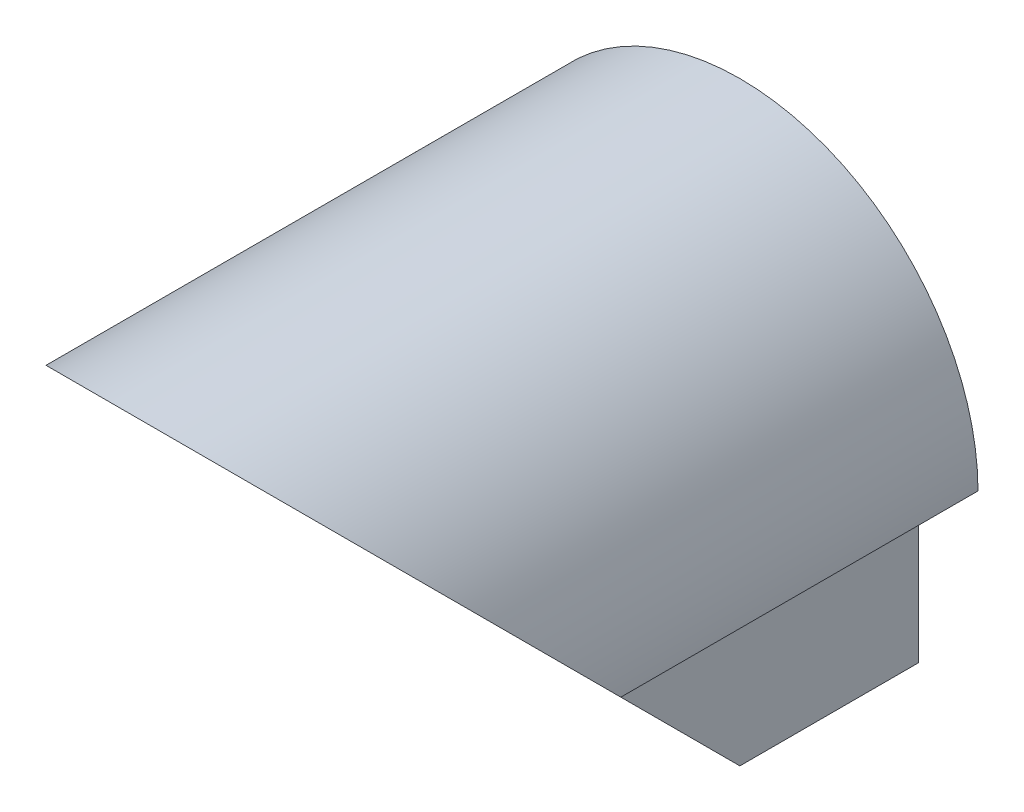
ISO-10303-21;
HEADER;
FILE_DESCRIPTION(('STEP AP214'),'2;1');
FILE_NAME('part.step','',(''),(''),'','','');
FILE_SCHEMA(('AUTOMOTIVE_DESIGN { 1 0 10303 214 1 1 1 1 }'));
ENDSEC;
DATA;
#1=APPLICATION_CONTEXT('core data for automotive mechanical design processes');
#2=APPLICATION_PROTOCOL_DEFINITION('international standard','automotive_design',2000,#1);
#3=PRODUCT_CONTEXT('',#1,'mechanical');
#4=PRODUCT('Part','Part','',(#3));
#5=PRODUCT_RELATED_PRODUCT_CATEGORY('part','',(#4));
#6=PRODUCT_DEFINITION_FORMATION('','',#4);
#7=PRODUCT_DEFINITION_CONTEXT('part definition',#1,'design');
#8=PRODUCT_DEFINITION('design','',#6,#7);
#9=PRODUCT_DEFINITION_SHAPE('','',#8);
#10=(LENGTH_UNIT() NAMED_UNIT(*) SI_UNIT(.MILLI.,.METRE.));
#11=(NAMED_UNIT(*) PLANE_ANGLE_UNIT() SI_UNIT($,.RADIAN.));
#12=(NAMED_UNIT(*) SI_UNIT($,.STERADIAN.) SOLID_ANGLE_UNIT());
#13=UNCERTAINTY_MEASURE_WITH_UNIT(LENGTH_MEASURE(1.E-05),#10,'distance_accuracy_value','');
#14=(GEOMETRIC_REPRESENTATION_CONTEXT(3) GLOBAL_UNCERTAINTY_ASSIGNED_CONTEXT((#13)) GLOBAL_UNIT_ASSIGNED_CONTEXT((#10,
#11,#12)) REPRESENTATION_CONTEXT('',''));
#15=CARTESIAN_POINT('',(0.,0.,0.));
#16=DIRECTION('',(0.,0.,1.));
#17=DIRECTION('',(1.,0.,0.));
#18=AXIS2_PLACEMENT_3D('',#15,#16,#17);
#19=CARTESIAN_POINT('',(0.,-1.,-5.));
#20=DIRECTION('',(0.,0.,-1.));
#21=DIRECTION('',(-1.,0.,0.));
#22=AXIS2_PLACEMENT_3D('',#19,#20,#21);
#23=PLANE('',#22);
#24=CARTESIAN_POINT('',(0.,-1.,-5.));
#25=DIRECTION('',(0.,0.,1.));
#26=DIRECTION('',(-1.,0.,0.));
#27=AXIS2_PLACEMENT_3D('',#24,#25,#26);
#28=CIRCLE('',#27,4.);
#29=CARTESIAN_POINT('',(4.,-0.999999999999999,-5.));
#30=VERTEX_POINT('',#29);
#31=CARTESIAN_POINT('',(-4.,-1.,-5.));
#32=VERTEX_POINT('',#31);
#33=EDGE_CURVE('E211',#30,#32,#28,.T.);
#34=ORIENTED_EDGE('',*,*,#33,.F.);
#35=DIRECTION('',(1.,0.,0.));
#36=VECTOR('',#35,1.);
#37=CARTESIAN_POINT('',(3.,-0.999999999999999,-5.));
#38=LINE('',#37,#36);
#39=CARTESIAN_POINT('',(3.,-0.999999999999999,-5.));
#40=VERTEX_POINT('',#39);
#41=EDGE_CURVE('E172',#40,#30,#38,.T.);
#42=ORIENTED_EDGE('',*,*,#41,.F.);
#43=DIRECTION('',(0.,1.,0.));
#44=VECTOR('',#43,1.);
#45=CARTESIAN_POINT('',(3.,-4.,-5.));
#46=LINE('',#45,#44);
#47=CARTESIAN_POINT('',(3.,-4.,-5.));
#48=VERTEX_POINT('',#47);
#49=EDGE_CURVE('E178',#48,#40,#46,.T.);
#50=ORIENTED_EDGE('',*,*,#49,.F.);
#51=DIRECTION('',(1.,0.,0.));
#52=VECTOR('',#51,1.);
#53=CARTESIAN_POINT('',(2.,-4.,-5.));
#54=LINE('',#53,#52);
#55=CARTESIAN_POINT('',(2.,-4.,-5.));
#56=VERTEX_POINT('',#55);
#57=EDGE_CURVE('E247',#56,#48,#54,.T.);
#58=ORIENTED_EDGE('',*,*,#57,.F.);
#59=DIRECTION('',(0.,-1.,0.));
#60=VECTOR('',#59,1.);
#61=CARTESIAN_POINT('',(2.,-3.,-5.));
#62=LINE('',#61,#60);
#63=CARTESIAN_POINT('',(2.,-3.,-5.));
#64=VERTEX_POINT('',#63);
#65=EDGE_CURVE('E244',#64,#56,#62,.T.);
#66=ORIENTED_EDGE('',*,*,#65,.F.);
#67=DIRECTION('',(1.,0.,0.));
#68=VECTOR('',#67,1.);
#69=CARTESIAN_POINT('',(1.,-3.,-5.));
#70=LINE('',#69,#68);
#71=CARTESIAN_POINT('',(1.,-3.,-5.));
#72=VERTEX_POINT('',#71);
#73=EDGE_CURVE('E241',#72,#64,#70,.T.);
#74=ORIENTED_EDGE('',*,*,#73,.F.);
#75=DIRECTION('',(0.,-1.,0.));
#76=VECTOR('',#75,1.);
#77=CARTESIAN_POINT('',(1.,-2.,-5.));
#78=LINE('',#77,#76);
#79=CARTESIAN_POINT('',(1.,-2.,-5.));
#80=VERTEX_POINT('',#79);
#81=EDGE_CURVE('E238',#80,#72,#78,.T.);
#82=ORIENTED_EDGE('',*,*,#81,.F.);
#83=DIRECTION('',(1.,0.,0.));
#84=VECTOR('',#83,1.);
#85=CARTESIAN_POINT('',(-0.999999999999999,-2.,-5.));
#86=LINE('',#85,#84);
#87=CARTESIAN_POINT('',(-0.999999999999999,-2.,-5.));
#88=VERTEX_POINT('',#87);
#89=EDGE_CURVE('E235',#88,#80,#86,.T.);
#90=ORIENTED_EDGE('',*,*,#89,.F.);
#91=DIRECTION('',(0.,1.,0.));
#92=VECTOR('',#91,1.);
#93=CARTESIAN_POINT('',(-0.999999999999999,-3.,-5.));
#94=LINE('',#93,#92);
#95=CARTESIAN_POINT('',(-0.999999999999999,-3.,-5.));
#96=VERTEX_POINT('',#95);
#97=EDGE_CURVE('E232',#96,#88,#94,.T.);
#98=ORIENTED_EDGE('',*,*,#97,.F.);
#99=DIRECTION('',(1.,0.,0.));
#100=VECTOR('',#99,1.);
#101=CARTESIAN_POINT('',(-2.,-3.,-5.));
#102=LINE('',#101,#100);
#103=CARTESIAN_POINT('',(-2.,-3.,-5.));
#104=VERTEX_POINT('',#103);
#105=EDGE_CURVE('E229',#104,#96,#102,.T.);
#106=ORIENTED_EDGE('',*,*,#105,.F.);
#107=DIRECTION('',(0.,1.,0.));
#108=VECTOR('',#107,1.);
#109=CARTESIAN_POINT('',(-2.,-4.,-5.));
#110=LINE('',#109,#108);
#111=CARTESIAN_POINT('',(-2.,-4.,-5.));
#112=VERTEX_POINT('',#111);
#113=EDGE_CURVE('E226',#112,#104,#110,.T.);
#114=ORIENTED_EDGE('',*,*,#113,.F.);
#115=DIRECTION('',(1.,0.,0.));
#116=VECTOR('',#115,1.);
#117=CARTESIAN_POINT('',(-3.,-4.,-5.));
#118=LINE('',#117,#116);
#119=CARTESIAN_POINT('',(-3.,-4.,-5.));
#120=VERTEX_POINT('',#119);
#121=EDGE_CURVE('E223',#120,#112,#118,.T.);
#122=ORIENTED_EDGE('',*,*,#121,.F.);
#123=DIRECTION('',(0.,-1.,0.));
#124=VECTOR('',#123,1.);
#125=CARTESIAN_POINT('',(-3.,-1.,-5.));
#126=LINE('',#125,#124);
#127=CARTESIAN_POINT('',(-3.,-1.,-5.));
#128=VERTEX_POINT('',#127);
#129=EDGE_CURVE('E214',#128,#120,#126,.T.);
#130=ORIENTED_EDGE('',*,*,#129,.F.);
#131=DIRECTION('',(1.,0.,0.));
#132=VECTOR('',#131,1.);
#133=CARTESIAN_POINT('',(-4.,-1.,-5.));
#134=LINE('',#133,#132);
#135=EDGE_CURVE('E207',#32,#128,#134,.T.);
#136=ORIENTED_EDGE('',*,*,#135,.F.);
#137=EDGE_LOOP('',(#34,#42,#50,#58,#66,#74,#82,#90,#98,#106,#114,#122,#130,#136));
#138=FACE_BOUND('',#137,.T.);
#139=DIRECTION('',(1.,0.,0.));
#140=VECTOR('',#139,1.);
#141=CARTESIAN_POINT('',(-2.,-1.,-5.));
#142=LINE('',#141,#140);
#143=CARTESIAN_POINT('',(-2.,-1.,-5.));
#144=VERTEX_POINT('',#143);
#145=CARTESIAN_POINT('',(2.,-1.,-5.));
#146=VERTEX_POINT('',#145);
#147=EDGE_CURVE('E330',#144,#146,#142,.T.);
#148=ORIENTED_EDGE('',*,*,#147,.T.);
#149=DIRECTION('',(0.,1.,0.));
#150=VECTOR('',#149,1.);
#151=CARTESIAN_POINT('',(2.,-1.,-5.));
#152=LINE('',#151,#150);
#153=CARTESIAN_POINT('',(2.,1.,-5.));
#154=VERTEX_POINT('',#153);
#155=EDGE_CURVE('E321',#146,#154,#152,.T.);
#156=ORIENTED_EDGE('',*,*,#155,.T.);
#157=DIRECTION('',(-1.,0.,0.));
#158=VECTOR('',#157,1.);
#159=CARTESIAN_POINT('',(-2.,1.,-5.));
#160=LINE('',#159,#158);
#161=CARTESIAN_POINT('',(-2.,1.,-5.));
#162=VERTEX_POINT('',#161);
#163=EDGE_CURVE('E324',#154,#162,#160,.T.);
#164=ORIENTED_EDGE('',*,*,#163,.T.);
#165=DIRECTION('',(0.,-1.,0.));
#166=VECTOR('',#165,1.);
#167=CARTESIAN_POINT('',(-2.,-1.,-5.));
#168=LINE('',#167,#166);
#169=EDGE_CURVE('E327',#162,#144,#168,.T.);
#170=ORIENTED_EDGE('',*,*,#169,.T.);
#171=EDGE_LOOP('',(#148,#156,#164,#170));
#172=FACE_BOUND('',#171,.T.);
#173=ADVANCED_FACE('F33',(#138,#172),#23,.T.);
#174=CARTESIAN_POINT('',(0.,-1.,5.));
#175=DIRECTION('',(0.,0.,-1.));
#176=DIRECTION('',(-1.,0.,0.));
#177=AXIS2_PLACEMENT_3D('',#174,#175,#176);
#178=CYLINDRICAL_SURFACE('',#177,4.);
#179=DIRECTION('',(0.,0.,-1.));
#180=VECTOR('',#179,1.);
#181=CARTESIAN_POINT('',(-4.,-1.,5.));
#182=LINE('',#181,#180);
#183=CARTESIAN_POINT('',(-4.,-1.,0.999999999999999));
#184=VERTEX_POINT('',#183);
#185=EDGE_CURVE('E41',#184,#32,#182,.T.);
#186=ORIENTED_EDGE('',*,*,#185,.F.);
#187=CARTESIAN_POINT('',(0.,-1.,0.999999999999998));
#188=DIRECTION('',(0.,0.707106781186548,-0.707106781186547));
#189=DIRECTION('',(0.,-0.707106781186547,-0.707106781186548));
#190=AXIS2_PLACEMENT_3D('',#187,#188,#189);
#191=ELLIPSE('',#190,5.65685424949238,4.);
#192=CARTESIAN_POINT('',(4.,-1.,1.));
#193=VERTEX_POINT('',#192);
#194=EDGE_CURVE('E157',#184,#193,#191,.T.);
#195=ORIENTED_EDGE('',*,*,#194,.T.);
#196=DIRECTION('',(0.,0.,-1.));
#197=VECTOR('',#196,1.);
#198=CARTESIAN_POINT('',(4.,-0.999999999999999,5.));
#199=LINE('',#198,#197);
#200=EDGE_CURVE('E160',#193,#30,#199,.T.);
#201=ORIENTED_EDGE('',*,*,#200,.T.);
#202=ORIENTED_EDGE('',*,*,#33,.T.);
#203=EDGE_LOOP('',(#186,#195,#201,#202));
#204=FACE_BOUND('',#203,.T.);
#205=ADVANCED_FACE('F35',(#204),#178,.T.);
#206=CARTESIAN_POINT('',(-4.,-1.,5.));
#207=DIRECTION('',(0.,1.,0.));
#208=DIRECTION('',(0.,0.,1.));
#209=AXIS2_PLACEMENT_3D('',#206,#207,#208);
#210=PLANE('',#209);
#211=DIRECTION('',(0.,0.,-1.));
#212=VECTOR('',#211,1.);
#213=CARTESIAN_POINT('',(-3.,-1.,5.));
#214=LINE('',#213,#212);
#215=CARTESIAN_POINT('',(-3.,-1.,0.999999999999999));
#216=VERTEX_POINT('',#215);
#217=EDGE_CURVE('E201',#216,#128,#214,.T.);
#218=ORIENTED_EDGE('',*,*,#217,.F.);
#219=DIRECTION('',(-1.,0.,0.));
#220=VECTOR('',#219,1.);
#221=CARTESIAN_POINT('',(-4.,-1.,0.999999999999999));
#222=LINE('',#221,#220);
#223=EDGE_CURVE('E163',#216,#184,#222,.T.);
#224=ORIENTED_EDGE('',*,*,#223,.T.);
#225=ORIENTED_EDGE('',*,*,#185,.T.);
#226=ORIENTED_EDGE('',*,*,#135,.T.);
#227=EDGE_LOOP('',(#218,#224,#225,#226));
#228=FACE_BOUND('',#227,.T.);
#229=ADVANCED_FACE('F206',(#228),#210,.F.);
#230=CARTESIAN_POINT('',(-3.,-1.,5.));
#231=DIRECTION('',(1.,0.,0.));
#232=DIRECTION('',(0.,1.,0.));
#233=AXIS2_PLACEMENT_3D('',#230,#231,#232);
#234=PLANE('',#233);
#235=DIRECTION('',(0.,0.,-1.));
#236=VECTOR('',#235,1.);
#237=CARTESIAN_POINT('',(-3.,-4.,5.));
#238=LINE('',#237,#236);
#239=CARTESIAN_POINT('',(-3.,-4.,-2.));
#240=VERTEX_POINT('',#239);
#241=EDGE_CURVE('E199',#240,#120,#238,.T.);
#242=ORIENTED_EDGE('',*,*,#241,.F.);
#243=DIRECTION('',(0.,0.707106781186547,0.707106781186548));
#244=VECTOR('',#243,1.);
#245=CARTESIAN_POINT('',(-3.,1.,3.));
#246=LINE('',#245,#244);
#247=EDGE_CURVE('E308',#240,#216,#246,.T.);
#248=ORIENTED_EDGE('',*,*,#247,.T.);
#249=ORIENTED_EDGE('',*,*,#217,.T.);
#250=ORIENTED_EDGE('',*,*,#129,.T.);
#251=EDGE_LOOP('',(#242,#248,#249,#250));
#252=FACE_BOUND('',#251,.T.);
#253=ADVANCED_FACE('F307',(#252),#234,.F.);
#254=CARTESIAN_POINT('',(-3.,-4.,5.));
#255=DIRECTION('',(0.,1.,0.));
#256=DIRECTION('',(0.,0.,1.));
#257=AXIS2_PLACEMENT_3D('',#254,#255,#256);
#258=PLANE('',#257);
#259=DIRECTION('',(0.,0.,-1.));
#260=VECTOR('',#259,1.);
#261=CARTESIAN_POINT('',(-2.,-4.,5.));
#262=LINE('',#261,#260);
#263=CARTESIAN_POINT('',(-2.,-4.,-2.));
#264=VERTEX_POINT('',#263);
#265=EDGE_CURVE('E197',#264,#112,#262,.T.);
#266=ORIENTED_EDGE('',*,*,#265,.F.);
#267=DIRECTION('',(1.,0.,0.));
#268=VECTOR('',#267,1.);
#269=CARTESIAN_POINT('',(-4.,-4.,-2.));
#270=LINE('',#269,#268);
#271=EDGE_CURVE('E304',#240,#264,#270,.T.);
#272=ORIENTED_EDGE('',*,*,#271,.F.);
#273=ORIENTED_EDGE('',*,*,#241,.T.);
#274=ORIENTED_EDGE('',*,*,#121,.T.);
#275=EDGE_LOOP('',(#266,#272,#273,#274));
#276=FACE_BOUND('',#275,.T.);
#277=ADVANCED_FACE('F302',(#276),#258,.F.);
#278=CARTESIAN_POINT('',(-2.,-4.,5.));
#279=DIRECTION('',(-1.,0.,0.));
#280=DIRECTION('',(0.,-1.,0.));
#281=AXIS2_PLACEMENT_3D('',#278,#279,#280);
#282=PLANE('',#281);
#283=DIRECTION('',(0.,0.,-1.));
#284=VECTOR('',#283,1.);
#285=CARTESIAN_POINT('',(-2.,-3.,5.));
#286=LINE('',#285,#284);
#287=CARTESIAN_POINT('',(-2.,-3.,-1.));
#288=VERTEX_POINT('',#287);
#289=EDGE_CURVE('E195',#288,#104,#286,.T.);
#290=ORIENTED_EDGE('',*,*,#289,.F.);
#291=DIRECTION('',(0.,-0.707106781186547,-0.707106781186548));
#292=VECTOR('',#291,1.);
#293=CARTESIAN_POINT('',(-2.,-0.5,1.5));
#294=LINE('',#293,#292);
#295=EDGE_CURVE('E299',#288,#264,#294,.T.);
#296=ORIENTED_EDGE('',*,*,#295,.T.);
#297=ORIENTED_EDGE('',*,*,#265,.T.);
#298=ORIENTED_EDGE('',*,*,#113,.T.);
#299=EDGE_LOOP('',(#290,#296,#297,#298));
#300=FACE_BOUND('',#299,.T.);
#301=ADVANCED_FACE('F297',(#300),#282,.F.);
#302=CARTESIAN_POINT('',(-2.,-3.,5.));
#303=DIRECTION('',(0.,1.,0.));
#304=DIRECTION('',(0.,0.,1.));
#305=AXIS2_PLACEMENT_3D('',#302,#303,#304);
#306=PLANE('',#305);
#307=DIRECTION('',(0.,0.,-1.));
#308=VECTOR('',#307,1.);
#309=CARTESIAN_POINT('',(-0.999999999999999,-3.,5.));
#310=LINE('',#309,#308);
#311=CARTESIAN_POINT('',(-0.999999999999999,-3.,-1.));
#312=VERTEX_POINT('',#311);
#313=EDGE_CURVE('E193',#312,#96,#310,.T.);
#314=ORIENTED_EDGE('',*,*,#313,.F.);
#315=DIRECTION('',(-1.,0.,0.));
#316=VECTOR('',#315,1.);
#317=CARTESIAN_POINT('',(-2.,-3.,-1.));
#318=LINE('',#317,#316);
#319=EDGE_CURVE('E294',#312,#288,#318,.T.);
#320=ORIENTED_EDGE('',*,*,#319,.T.);
#321=ORIENTED_EDGE('',*,*,#289,.T.);
#322=ORIENTED_EDGE('',*,*,#105,.T.);
#323=EDGE_LOOP('',(#314,#320,#321,#322));
#324=FACE_BOUND('',#323,.T.);
#325=ADVANCED_FACE('F291',(#324),#306,.F.);
#326=CARTESIAN_POINT('',(-0.999999999999999,-3.,5.));
#327=DIRECTION('',(-1.,0.,0.));
#328=DIRECTION('',(0.,0.,1.));
#329=AXIS2_PLACEMENT_3D('',#326,#327,#328);
#330=PLANE('',#329);
#331=DIRECTION('',(0.,0.,-1.));
#332=VECTOR('',#331,1.);
#333=CARTESIAN_POINT('',(-0.999999999999999,-2.,5.));
#334=LINE('',#333,#332);
#335=CARTESIAN_POINT('',(-0.999999999999999,-2.,0.));
#336=VERTEX_POINT('',#335);
#337=EDGE_CURVE('E191',#336,#88,#334,.T.);
#338=ORIENTED_EDGE('',*,*,#337,.F.);
#339=DIRECTION('',(0.,-0.707106781186547,-0.707106781186548));
#340=VECTOR('',#339,1.);
#341=CARTESIAN_POINT('',(-0.999999999999999,0.,2.));
#342=LINE('',#341,#340);
#343=EDGE_CURVE('E317',#336,#312,#342,.T.);
#344=ORIENTED_EDGE('',*,*,#343,.T.);
#345=ORIENTED_EDGE('',*,*,#313,.T.);
#346=ORIENTED_EDGE('',*,*,#97,.T.);
#347=EDGE_LOOP('',(#338,#344,#345,#346));
#348=FACE_BOUND('',#347,.T.);
#349=ADVANCED_FACE('F286',(#348),#330,.F.);
#350=CARTESIAN_POINT('',(-0.999999999999999,-2.,5.));
#351=DIRECTION('',(0.,1.,0.));
#352=DIRECTION('',(0.,0.,1.));
#353=AXIS2_PLACEMENT_3D('',#350,#351,#352);
#354=PLANE('',#353);
#355=DIRECTION('',(0.,0.,-1.));
#356=VECTOR('',#355,1.);
#357=CARTESIAN_POINT('',(1.,-2.,5.));
#358=LINE('',#357,#356);
#359=CARTESIAN_POINT('',(1.,-2.,0.));
#360=VERTEX_POINT('',#359);
#361=EDGE_CURVE('E189',#360,#80,#358,.T.);
#362=ORIENTED_EDGE('',*,*,#361,.F.);
#363=DIRECTION('',(-1.,0.,0.));
#364=VECTOR('',#363,1.);
#365=CARTESIAN_POINT('',(-0.999999999999999,-2.,0.));
#366=LINE('',#365,#364);
#367=EDGE_CURVE('E283',#360,#336,#366,.T.);
#368=ORIENTED_EDGE('',*,*,#367,.T.);
#369=ORIENTED_EDGE('',*,*,#337,.T.);
#370=ORIENTED_EDGE('',*,*,#89,.T.);
#371=EDGE_LOOP('',(#362,#368,#369,#370));
#372=FACE_BOUND('',#371,.T.);
#373=ADVANCED_FACE('F281',(#372),#354,.F.);
#374=CARTESIAN_POINT('',(1.,-2.,5.));
#375=DIRECTION('',(1.,0.,0.));
#376=DIRECTION('',(0.,0.,-1.));
#377=AXIS2_PLACEMENT_3D('',#374,#375,#376);
#378=PLANE('',#377);
#379=DIRECTION('',(0.,0.,-1.));
#380=VECTOR('',#379,1.);
#381=CARTESIAN_POINT('',(1.,-3.,5.));
#382=LINE('',#381,#380);
#383=CARTESIAN_POINT('',(1.,-3.,-1.));
#384=VERTEX_POINT('',#383);
#385=EDGE_CURVE('E187',#384,#72,#382,.T.);
#386=ORIENTED_EDGE('',*,*,#385,.F.);
#387=DIRECTION('',(0.,0.707106781186547,0.707106781186548));
#388=VECTOR('',#387,1.);
#389=CARTESIAN_POINT('',(1.,0.5,2.5));
#390=LINE('',#389,#388);
#391=EDGE_CURVE('E278',#384,#360,#390,.T.);
#392=ORIENTED_EDGE('',*,*,#391,.T.);
#393=ORIENTED_EDGE('',*,*,#361,.T.);
#394=ORIENTED_EDGE('',*,*,#81,.T.);
#395=EDGE_LOOP('',(#386,#392,#393,#394));
#396=FACE_BOUND('',#395,.T.);
#397=ADVANCED_FACE('F275',(#396),#378,.F.);
#398=CARTESIAN_POINT('',(1.,-3.,5.));
#399=DIRECTION('',(0.,1.,0.));
#400=DIRECTION('',(0.,0.,1.));
#401=AXIS2_PLACEMENT_3D('',#398,#399,#400);
#402=PLANE('',#401);
#403=DIRECTION('',(0.,0.,-1.));
#404=VECTOR('',#403,1.);
#405=CARTESIAN_POINT('',(2.,-3.,5.));
#406=LINE('',#405,#404);
#407=CARTESIAN_POINT('',(2.,-3.,-1.));
#408=VERTEX_POINT('',#407);
#409=EDGE_CURVE('E185',#408,#64,#406,.T.);
#410=ORIENTED_EDGE('',*,*,#409,.F.);
#411=DIRECTION('',(-1.,0.,0.));
#412=VECTOR('',#411,1.);
#413=CARTESIAN_POINT('',(1.,-3.,-1.));
#414=LINE('',#413,#412);
#415=EDGE_CURVE('E310',#408,#384,#414,.T.);
#416=ORIENTED_EDGE('',*,*,#415,.T.);
#417=ORIENTED_EDGE('',*,*,#385,.T.);
#418=ORIENTED_EDGE('',*,*,#73,.T.);
#419=EDGE_LOOP('',(#410,#416,#417,#418));
#420=FACE_BOUND('',#419,.T.);
#421=ADVANCED_FACE('F269',(#420),#402,.F.);
#422=CARTESIAN_POINT('',(2.,-3.,5.));
#423=DIRECTION('',(1.,0.,0.));
#424=DIRECTION('',(0.,1.,0.));
#425=AXIS2_PLACEMENT_3D('',#422,#423,#424);
#426=PLANE('',#425);
#427=DIRECTION('',(0.,0.,-1.));
#428=VECTOR('',#427,1.);
#429=CARTESIAN_POINT('',(2.,-4.,5.));
#430=LINE('',#429,#428);
#431=CARTESIAN_POINT('',(2.,-4.,-2.));
#432=VERTEX_POINT('',#431);
#433=EDGE_CURVE('E183',#432,#56,#430,.T.);
#434=ORIENTED_EDGE('',*,*,#433,.F.);
#435=DIRECTION('',(0.,0.707106781186547,0.707106781186548));
#436=VECTOR('',#435,1.);
#437=CARTESIAN_POINT('',(2.,0.,2.));
#438=LINE('',#437,#436);
#439=EDGE_CURVE('E266',#432,#408,#438,.T.);
#440=ORIENTED_EDGE('',*,*,#439,.T.);
#441=ORIENTED_EDGE('',*,*,#409,.T.);
#442=ORIENTED_EDGE('',*,*,#65,.T.);
#443=EDGE_LOOP('',(#434,#440,#441,#442));
#444=FACE_BOUND('',#443,.T.);
#445=ADVANCED_FACE('F264',(#444),#426,.F.);
#446=CARTESIAN_POINT('',(2.,-4.,5.));
#447=DIRECTION('',(0.,1.,0.));
#448=DIRECTION('',(-1.,0.,0.));
#449=AXIS2_PLACEMENT_3D('',#446,#447,#448);
#450=PLANE('',#449);
#451=DIRECTION('',(0.,0.,-1.));
#452=VECTOR('',#451,1.);
#453=CARTESIAN_POINT('',(3.,-4.,5.));
#454=LINE('',#453,#452);
#455=CARTESIAN_POINT('',(3.,-4.,-2.));
#456=VERTEX_POINT('',#455);
#457=EDGE_CURVE('E176',#456,#48,#454,.T.);
#458=ORIENTED_EDGE('',*,*,#457,.F.);
#459=EDGE_CURVE('E261',#432,#456,#270,.T.);
#460=ORIENTED_EDGE('',*,*,#459,.F.);
#461=ORIENTED_EDGE('',*,*,#433,.T.);
#462=ORIENTED_EDGE('',*,*,#57,.T.);
#463=EDGE_LOOP('',(#458,#460,#461,#462));
#464=FACE_BOUND('',#463,.T.);
#465=ADVANCED_FACE('F258',(#464),#450,.F.);
#466=CARTESIAN_POINT('',(3.,-4.,5.));
#467=DIRECTION('',(-1.,0.,0.));
#468=DIRECTION('',(0.,-1.,0.));
#469=AXIS2_PLACEMENT_3D('',#466,#467,#468);
#470=PLANE('',#469);
#471=DIRECTION('',(0.,0.,-1.));
#472=VECTOR('',#471,1.);
#473=CARTESIAN_POINT('',(3.,-0.999999999999999,5.));
#474=LINE('',#473,#472);
#475=CARTESIAN_POINT('',(3.,-0.999999999999999,1.));
#476=VERTEX_POINT('',#475);
#477=EDGE_CURVE('E174',#476,#40,#474,.T.);
#478=ORIENTED_EDGE('',*,*,#477,.F.);
#479=DIRECTION('',(0.,-0.707106781186547,-0.707106781186548));
#480=VECTOR('',#479,1.);
#481=CARTESIAN_POINT('',(3.,-0.499999999999999,1.5));
#482=LINE('',#481,#480);
#483=EDGE_CURVE('E48',#476,#456,#482,.T.);
#484=ORIENTED_EDGE('',*,*,#483,.T.);
#485=ORIENTED_EDGE('',*,*,#457,.T.);
#486=ORIENTED_EDGE('',*,*,#49,.T.);
#487=EDGE_LOOP('',(#478,#484,#485,#486));
#488=FACE_BOUND('',#487,.T.);
#489=ADVANCED_FACE('F252',(#488),#470,.F.);
#490=CARTESIAN_POINT('',(3.,-0.999999999999999,5.));
#491=DIRECTION('',(0.,1.,0.));
#492=DIRECTION('',(-1.,0.,0.));
#493=AXIS2_PLACEMENT_3D('',#490,#491,#492);
#494=PLANE('',#493);
#495=ORIENTED_EDGE('',*,*,#200,.F.);
#496=DIRECTION('',(-1.,0.,0.));
#497=VECTOR('',#496,1.);
#498=CARTESIAN_POINT('',(3.,-0.999999999999999,1.));
#499=LINE('',#498,#497);
#500=EDGE_CURVE('E165',#193,#476,#499,.T.);
#501=ORIENTED_EDGE('',*,*,#500,.T.);
#502=ORIENTED_EDGE('',*,*,#477,.T.);
#503=ORIENTED_EDGE('',*,*,#41,.T.);
#504=EDGE_LOOP('',(#495,#501,#502,#503));
#505=FACE_BOUND('',#504,.T.);
#506=ADVANCED_FACE('F170',(#505),#494,.F.);
#507=CARTESIAN_POINT('',(2.,-1.,5.));
#508=DIRECTION('',(-1.,0.,0.));
#509=DIRECTION('',(0.,0.,1.));
#510=AXIS2_PLACEMENT_3D('',#507,#508,#509);
#511=PLANE('',#510);
#512=DIRECTION('',(0.,-0.707106781186547,-0.707106781186548));
#513=VECTOR('',#512,1.);
#514=CARTESIAN_POINT('',(2.,1.,3.));
#515=LINE('',#514,#513);
#516=CARTESIAN_POINT('',(2.,1.,3.));
#517=VERTEX_POINT('',#516);
#518=CARTESIAN_POINT('',(2.,-1.,0.999999999999999));
#519=VERTEX_POINT('',#518);
#520=EDGE_CURVE('E55',#517,#519,#515,.T.);
#521=ORIENTED_EDGE('',*,*,#520,.F.);
#522=DIRECTION('',(0.,0.,-1.));
#523=VECTOR('',#522,1.);
#524=CARTESIAN_POINT('',(2.,1.,5.));
#525=LINE('',#524,#523);
#526=EDGE_CURVE('E216',#517,#154,#525,.T.);
#527=ORIENTED_EDGE('',*,*,#526,.T.);
#528=ORIENTED_EDGE('',*,*,#155,.F.);
#529=DIRECTION('',(0.,0.,-1.));
#530=VECTOR('',#529,1.);
#531=CARTESIAN_POINT('',(2.,-1.,5.));
#532=LINE('',#531,#530);
#533=EDGE_CURVE('E333',#519,#146,#532,.T.);
#534=ORIENTED_EDGE('',*,*,#533,.F.);
#535=EDGE_LOOP('',(#521,#527,#528,#534));
#536=FACE_BOUND('',#535,.T.);
#537=ADVANCED_FACE('F352',(#536),#511,.T.);
#538=CARTESIAN_POINT('',(-2.,1.,5.));
#539=DIRECTION('',(0.,-1.,0.));
#540=DIRECTION('',(0.,0.,-1.));
#541=AXIS2_PLACEMENT_3D('',#538,#539,#540);
#542=PLANE('',#541);
#543=DIRECTION('',(1.,0.,0.));
#544=VECTOR('',#543,1.);
#545=CARTESIAN_POINT('',(-2.,1.,3.));
#546=LINE('',#545,#544);
#547=CARTESIAN_POINT('',(-2.,1.,3.));
#548=VERTEX_POINT('',#547);
#549=EDGE_CURVE('E343',#548,#517,#546,.T.);
#550=ORIENTED_EDGE('',*,*,#549,.F.);
#551=DIRECTION('',(0.,0.,-1.));
#552=VECTOR('',#551,1.);
#553=CARTESIAN_POINT('',(-2.,1.,5.));
#554=LINE('',#553,#552);
#555=EDGE_CURVE('E218',#548,#162,#554,.T.);
#556=ORIENTED_EDGE('',*,*,#555,.T.);
#557=ORIENTED_EDGE('',*,*,#163,.F.);
#558=ORIENTED_EDGE('',*,*,#526,.F.);
#559=EDGE_LOOP('',(#550,#556,#557,#558));
#560=FACE_BOUND('',#559,.T.);
#561=ADVANCED_FACE('F341',(#560),#542,.T.);
#562=CARTESIAN_POINT('',(-2.,-1.,5.));
#563=DIRECTION('',(1.,0.,0.));
#564=DIRECTION('',(0.,0.,-1.));
#565=AXIS2_PLACEMENT_3D('',#562,#563,#564);
#566=PLANE('',#565);
#567=DIRECTION('',(0.,0.707106781186547,0.707106781186548));
#568=VECTOR('',#567,1.);
#569=CARTESIAN_POINT('',(-2.,1.,3.));
#570=LINE('',#569,#568);
#571=CARTESIAN_POINT('',(-2.,-1.,0.999999999999999));
#572=VERTEX_POINT('',#571);
#573=EDGE_CURVE('E354',#572,#548,#570,.T.);
#574=ORIENTED_EDGE('',*,*,#573,.F.);
#575=DIRECTION('',(0.,0.,-1.));
#576=VECTOR('',#575,1.);
#577=CARTESIAN_POINT('',(-2.,-1.,5.));
#578=LINE('',#577,#576);
#579=EDGE_CURVE('E335',#572,#144,#578,.T.);
#580=ORIENTED_EDGE('',*,*,#579,.T.);
#581=ORIENTED_EDGE('',*,*,#169,.F.);
#582=ORIENTED_EDGE('',*,*,#555,.F.);
#583=EDGE_LOOP('',(#574,#580,#581,#582));
#584=FACE_BOUND('',#583,.T.);
#585=ADVANCED_FACE('F346',(#584),#566,.T.);
#586=CARTESIAN_POINT('',(-2.,-1.,5.));
#587=DIRECTION('',(0.,1.,0.));
#588=DIRECTION('',(0.,0.,1.));
#589=AXIS2_PLACEMENT_3D('',#586,#587,#588);
#590=PLANE('',#589);
#591=DIRECTION('',(-1.,0.,0.));
#592=VECTOR('',#591,1.);
#593=CARTESIAN_POINT('',(-2.,-1.,0.999999999999999));
#594=LINE('',#593,#592);
#595=EDGE_CURVE('E11',#519,#572,#594,.T.);
#596=ORIENTED_EDGE('',*,*,#595,.F.);
#597=ORIENTED_EDGE('',*,*,#533,.T.);
#598=ORIENTED_EDGE('',*,*,#147,.F.);
#599=ORIENTED_EDGE('',*,*,#579,.F.);
#600=EDGE_LOOP('',(#596,#597,#598,#599));
#601=FACE_BOUND('',#600,.T.);
#602=ADVANCED_FACE('F360',(#601),#590,.T.);
#603=CARTESIAN_POINT('',(-4.,3.,5.));
#604=DIRECTION('',(0.,0.707106781186548,-0.707106781186547));
#605=DIRECTION('',(0.,0.707106781186547,0.707106781186548));
#606=AXIS2_PLACEMENT_3D('',#603,#604,#605);
#607=PLANE('',#606);
#608=ORIENTED_EDGE('',*,*,#520,.T.);
#609=ORIENTED_EDGE('',*,*,#595,.T.);
#610=ORIENTED_EDGE('',*,*,#573,.T.);
#611=ORIENTED_EDGE('',*,*,#549,.T.);
#612=EDGE_LOOP('',(#608,#609,#610,#611));
#613=FACE_BOUND('',#612,.T.);
#614=ORIENTED_EDGE('',*,*,#319,.F.);
#615=ORIENTED_EDGE('',*,*,#343,.F.);
#616=ORIENTED_EDGE('',*,*,#367,.F.);
#617=ORIENTED_EDGE('',*,*,#391,.F.);
#618=ORIENTED_EDGE('',*,*,#415,.F.);
#619=ORIENTED_EDGE('',*,*,#439,.F.);
#620=ORIENTED_EDGE('',*,*,#459,.T.);
#621=ORIENTED_EDGE('',*,*,#483,.F.);
#622=ORIENTED_EDGE('',*,*,#500,.F.);
#623=ORIENTED_EDGE('',*,*,#194,.F.);
#624=ORIENTED_EDGE('',*,*,#223,.F.);
#625=ORIENTED_EDGE('',*,*,#247,.F.);
#626=ORIENTED_EDGE('',*,*,#271,.T.);
#627=ORIENTED_EDGE('',*,*,#295,.F.);
#628=EDGE_LOOP('',(#614,#615,#616,#617,#618,#619,#620,#621,#622,#623,#624,#625,#626,#627));
#629=FACE_BOUND('',#628,.T.);
#630=ADVANCED_FACE('F166',(#613,#629),#607,.F.);
#631=CLOSED_SHELL('',(#173,#205,#229,#253,#277,#301,#325,#349,#373,#397,#421,#445,#465,#489,
#506,#537,#561,#585,#602,#630));
#632=MANIFOLD_SOLID_BREP('B2',#631);
#633=ADVANCED_BREP_SHAPE_REPRESENTATION('',(#18,#632),#14);
#634=SHAPE_DEFINITION_REPRESENTATION(#9,#633);
ENDSEC;
END-ISO-10303-21;
